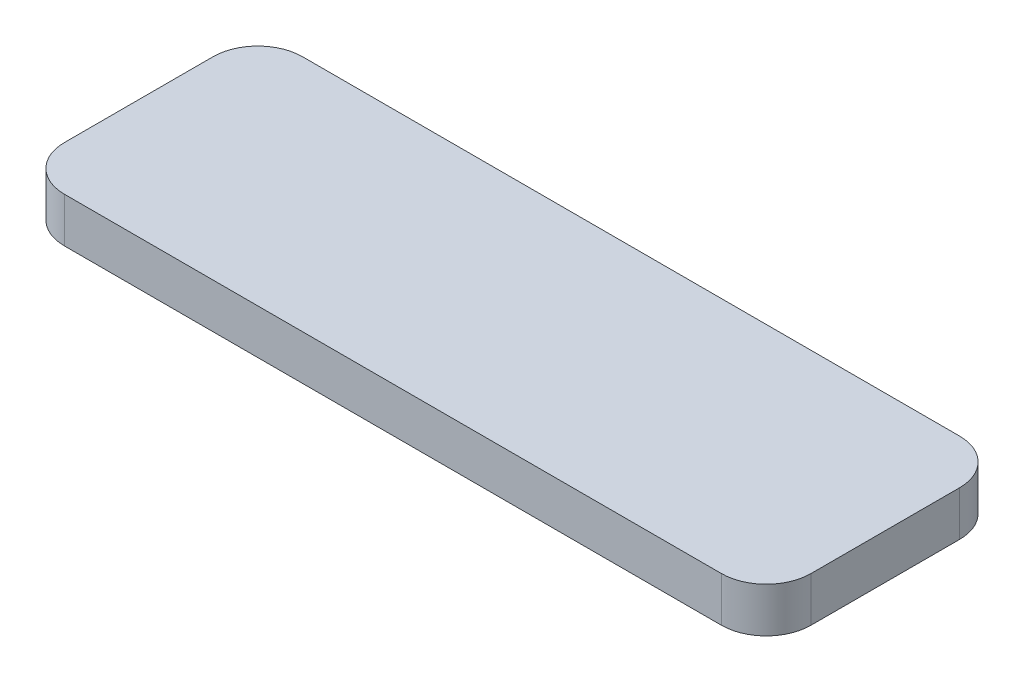
ISO-10303-21;
HEADER;
FILE_DESCRIPTION(('STEP AP214'),'2;1');
FILE_NAME('part.step','',(''),(''),'','','');
FILE_SCHEMA(('AUTOMOTIVE_DESIGN { 1 0 10303 214 1 1 1 1 }'));
ENDSEC;
DATA;
#1=APPLICATION_CONTEXT('core data for automotive mechanical design processes');
#2=APPLICATION_PROTOCOL_DEFINITION('international standard','automotive_design',2000,#1);
#3=PRODUCT_CONTEXT('',#1,'mechanical');
#4=PRODUCT('Part','Part','',(#3));
#5=PRODUCT_RELATED_PRODUCT_CATEGORY('part','',(#4));
#6=PRODUCT_DEFINITION_FORMATION('','',#4);
#7=PRODUCT_DEFINITION_CONTEXT('part definition',#1,'design');
#8=PRODUCT_DEFINITION('design','',#6,#7);
#9=PRODUCT_DEFINITION_SHAPE('','',#8);
#10=(LENGTH_UNIT() NAMED_UNIT(*) SI_UNIT(.MILLI.,.METRE.));
#11=(NAMED_UNIT(*) PLANE_ANGLE_UNIT() SI_UNIT($,.RADIAN.));
#12=(NAMED_UNIT(*) SI_UNIT($,.STERADIAN.) SOLID_ANGLE_UNIT());
#13=UNCERTAINTY_MEASURE_WITH_UNIT(LENGTH_MEASURE(1.E-05),#10,'distance_accuracy_value','');
#14=(GEOMETRIC_REPRESENTATION_CONTEXT(3) GLOBAL_UNCERTAINTY_ASSIGNED_CONTEXT((#13)) GLOBAL_UNIT_ASSIGNED_CONTEXT((#10,
#11,#12)) REPRESENTATION_CONTEXT('',''));
#15=CARTESIAN_POINT('',(0.,0.,0.));
#16=DIRECTION('',(0.,0.,1.));
#17=DIRECTION('',(1.,0.,0.));
#18=AXIS2_PLACEMENT_3D('',#15,#16,#17);
#19=CARTESIAN_POINT('',(0.,3.,0.));
#20=DIRECTION('',(1.,0.,0.));
#21=DIRECTION('',(0.,0.,-1.));
#22=AXIS2_PLACEMENT_3D('',#19,#20,#21);
#23=PLANE('',#22);
#24=DIRECTION('',(0.,0.,1.));
#25=VECTOR('',#24,1.);
#26=CARTESIAN_POINT('',(0.,0.,0.));
#27=LINE('',#26,#25);
#28=CARTESIAN_POINT('',(0.,0.,-12.95));
#29=VERTEX_POINT('',#28);
#30=CARTESIAN_POINT('',(0.,0.,-3.));
#31=VERTEX_POINT('',#30);
#32=EDGE_CURVE('E140',#29,#31,#27,.T.);
#33=ORIENTED_EDGE('',*,*,#32,.T.);
#34=DIRECTION('',(0.,-1.,0.));
#35=VECTOR('',#34,1.);
#36=CARTESIAN_POINT('',(0.,3.,-3.));
#37=LINE('',#36,#35);
#38=CARTESIAN_POINT('',(0.,3.,-3.));
#39=VERTEX_POINT('',#38);
#40=EDGE_CURVE('E11',#31,#39,#37,.F.);
#41=ORIENTED_EDGE('',*,*,#40,.T.);
#42=DIRECTION('',(0.,0.,1.));
#43=VECTOR('',#42,1.);
#44=CARTESIAN_POINT('',(0.,3.,0.));
#45=LINE('',#44,#43);
#46=CARTESIAN_POINT('',(0.,3.,-12.95));
#47=VERTEX_POINT('',#46);
#48=EDGE_CURVE('E138',#47,#39,#45,.T.);
#49=ORIENTED_EDGE('',*,*,#48,.F.);
#50=DIRECTION('',(0.,-1.,0.));
#51=VECTOR('',#50,1.);
#52=CARTESIAN_POINT('',(0.,3.,-12.95));
#53=LINE('',#52,#51);
#54=EDGE_CURVE('E47',#47,#29,#53,.T.);
#55=ORIENTED_EDGE('',*,*,#54,.T.);
#56=EDGE_LOOP('',(#33,#41,#49,#55));
#57=FACE_BOUND('',#56,.T.);
#58=ADVANCED_FACE('F38',(#57),#23,.F.);
#59=CARTESIAN_POINT('',(0.,3.,0.));
#60=DIRECTION('',(0.,0.,-1.));
#61=DIRECTION('',(-1.,0.,0.));
#62=AXIS2_PLACEMENT_3D('',#59,#60,#61);
#63=PLANE('',#62);
#64=DIRECTION('',(1.,0.,0.));
#65=VECTOR('',#64,1.);
#66=CARTESIAN_POINT('',(0.,0.,0.));
#67=LINE('',#66,#65);
#68=CARTESIAN_POINT('',(3.,0.,0.));
#69=VERTEX_POINT('',#68);
#70=CARTESIAN_POINT('',(47.,0.,0.));
#71=VERTEX_POINT('',#70);
#72=EDGE_CURVE('E134',#69,#71,#67,.T.);
#73=ORIENTED_EDGE('',*,*,#72,.T.);
#74=DIRECTION('',(0.,-1.,0.));
#75=VECTOR('',#74,1.);
#76=CARTESIAN_POINT('',(47.,3.,0.));
#77=LINE('',#76,#75);
#78=CARTESIAN_POINT('',(47.,3.,0.));
#79=VERTEX_POINT('',#78);
#80=EDGE_CURVE('E110',#71,#79,#77,.F.);
#81=ORIENTED_EDGE('',*,*,#80,.T.);
#82=DIRECTION('',(1.,0.,0.));
#83=VECTOR('',#82,1.);
#84=CARTESIAN_POINT('',(0.,3.,0.));
#85=LINE('',#84,#83);
#86=CARTESIAN_POINT('',(3.,3.,0.));
#87=VERTEX_POINT('',#86);
#88=EDGE_CURVE('E192',#87,#79,#85,.T.);
#89=ORIENTED_EDGE('',*,*,#88,.F.);
#90=DIRECTION('',(0.,-1.,0.));
#91=VECTOR('',#90,1.);
#92=CARTESIAN_POINT('',(3.,3.,0.));
#93=LINE('',#92,#91);
#94=EDGE_CURVE('E116',#87,#69,#93,.T.);
#95=ORIENTED_EDGE('',*,*,#94,.T.);
#96=EDGE_LOOP('',(#73,#81,#89,#95));
#97=FACE_BOUND('',#96,.T.);
#98=ADVANCED_FACE('F204',(#97),#63,.F.);
#99=CARTESIAN_POINT('',(50.,3.,0.));
#100=DIRECTION('',(-1.,0.,0.));
#101=DIRECTION('',(0.,0.,1.));
#102=AXIS2_PLACEMENT_3D('',#99,#100,#101);
#103=PLANE('',#102);
#104=DIRECTION('',(0.,0.,-1.));
#105=VECTOR('',#104,1.);
#106=CARTESIAN_POINT('',(50.,3.,0.));
#107=LINE('',#106,#105);
#108=CARTESIAN_POINT('',(50.,3.,-3.));
#109=VERTEX_POINT('',#108);
#110=CARTESIAN_POINT('',(50.,3.,-12.95));
#111=VERTEX_POINT('',#110);
#112=EDGE_CURVE('E125',#109,#111,#107,.T.);
#113=ORIENTED_EDGE('',*,*,#112,.F.);
#114=DIRECTION('',(0.,-1.,0.));
#115=VECTOR('',#114,1.);
#116=CARTESIAN_POINT('',(50.,3.,-3.));
#117=LINE('',#116,#115);
#118=CARTESIAN_POINT('',(50.,0.,-3.));
#119=VERTEX_POINT('',#118);
#120=EDGE_CURVE('E109',#109,#119,#117,.T.);
#121=ORIENTED_EDGE('',*,*,#120,.T.);
#122=DIRECTION('',(0.,0.,-1.));
#123=VECTOR('',#122,1.);
#124=CARTESIAN_POINT('',(50.,0.,0.));
#125=LINE('',#124,#123);
#126=CARTESIAN_POINT('',(50.,0.,-12.95));
#127=VERTEX_POINT('',#126);
#128=EDGE_CURVE('E123',#119,#127,#125,.T.);
#129=ORIENTED_EDGE('',*,*,#128,.T.);
#130=DIRECTION('',(0.,-1.,0.));
#131=VECTOR('',#130,1.);
#132=CARTESIAN_POINT('',(50.,3.,-12.95));
#133=LINE('',#132,#131);
#134=EDGE_CURVE('E128',#127,#111,#133,.F.);
#135=ORIENTED_EDGE('',*,*,#134,.T.);
#136=EDGE_LOOP('',(#113,#121,#129,#135));
#137=FACE_BOUND('',#136,.T.);
#138=ADVANCED_FACE('F122',(#137),#103,.F.);
#139=CARTESIAN_POINT('',(0.,3.,-15.95));
#140=DIRECTION('',(0.,0.,1.));
#141=DIRECTION('',(1.,0.,0.));
#142=AXIS2_PLACEMENT_3D('',#139,#140,#141);
#143=PLANE('',#142);
#144=DIRECTION('',(-1.,0.,0.));
#145=VECTOR('',#144,1.);
#146=CARTESIAN_POINT('',(0.,3.,-15.95));
#147=LINE('',#146,#145);
#148=CARTESIAN_POINT('',(47.,3.,-15.95));
#149=VERTEX_POINT('',#148);
#150=CARTESIAN_POINT('',(3.,3.,-15.95));
#151=VERTEX_POINT('',#150);
#152=EDGE_CURVE('E145',#149,#151,#147,.T.);
#153=ORIENTED_EDGE('',*,*,#152,.F.);
#154=DIRECTION('',(0.,-1.,0.));
#155=VECTOR('',#154,1.);
#156=CARTESIAN_POINT('',(47.,3.,-15.95));
#157=LINE('',#156,#155);
#158=CARTESIAN_POINT('',(47.,0.,-15.95));
#159=VERTEX_POINT('',#158);
#160=EDGE_CURVE('E172',#149,#159,#157,.T.);
#161=ORIENTED_EDGE('',*,*,#160,.T.);
#162=DIRECTION('',(-1.,0.,0.));
#163=VECTOR('',#162,1.);
#164=CARTESIAN_POINT('',(0.,0.,-15.95));
#165=LINE('',#164,#163);
#166=CARTESIAN_POINT('',(3.,0.,-15.95));
#167=VERTEX_POINT('',#166);
#168=EDGE_CURVE('E133',#159,#167,#165,.T.);
#169=ORIENTED_EDGE('',*,*,#168,.T.);
#170=DIRECTION('',(0.,-1.,0.));
#171=VECTOR('',#170,1.);
#172=CARTESIAN_POINT('',(3.,3.,-15.95));
#173=LINE('',#172,#171);
#174=EDGE_CURVE('E54',#167,#151,#173,.F.);
#175=ORIENTED_EDGE('',*,*,#174,.T.);
#176=EDGE_LOOP('',(#153,#161,#169,#175));
#177=FACE_BOUND('',#176,.T.);
#178=ADVANCED_FACE('F208',(#177),#143,.F.);
#179=CARTESIAN_POINT('',(0.,3.,0.));
#180=DIRECTION('',(0.,-1.,0.));
#181=DIRECTION('',(0.,0.,-1.));
#182=AXIS2_PLACEMENT_3D('',#179,#180,#181);
#183=PLANE('',#182);
#184=ORIENTED_EDGE('',*,*,#88,.T.);
#185=CARTESIAN_POINT('',(47.,3.,-3.));
#186=DIRECTION('',(0.,-1.,0.));
#187=DIRECTION('',(0.,0.,-1.));
#188=AXIS2_PLACEMENT_3D('',#185,#186,#187);
#189=CIRCLE('',#188,3.);
#190=EDGE_CURVE('E167',#79,#109,#189,.F.);
#191=ORIENTED_EDGE('',*,*,#190,.T.);
#192=ORIENTED_EDGE('',*,*,#112,.T.);
#193=CARTESIAN_POINT('',(47.,3.,-12.95));
#194=DIRECTION('',(0.,-1.,0.));
#195=DIRECTION('',(0.,0.,-1.));
#196=AXIS2_PLACEMENT_3D('',#193,#194,#195);
#197=CIRCLE('',#196,3.);
#198=EDGE_CURVE('E61',#111,#149,#197,.F.);
#199=ORIENTED_EDGE('',*,*,#198,.T.);
#200=ORIENTED_EDGE('',*,*,#152,.T.);
#201=CARTESIAN_POINT('',(3.,3.,-12.95));
#202=DIRECTION('',(0.,-1.,0.));
#203=DIRECTION('',(0.,0.,-1.));
#204=AXIS2_PLACEMENT_3D('',#201,#202,#203);
#205=CIRCLE('',#204,3.);
#206=EDGE_CURVE('E159',#151,#47,#205,.F.);
#207=ORIENTED_EDGE('',*,*,#206,.T.);
#208=ORIENTED_EDGE('',*,*,#48,.T.);
#209=CARTESIAN_POINT('',(3.,3.,-3.));
#210=DIRECTION('',(0.,-1.,0.));
#211=DIRECTION('',(0.,0.,-1.));
#212=AXIS2_PLACEMENT_3D('',#209,#210,#211);
#213=CIRCLE('',#212,3.);
#214=EDGE_CURVE('E162',#39,#87,#213,.F.);
#215=ORIENTED_EDGE('',*,*,#214,.T.);
#216=EDGE_LOOP('',(#184,#191,#192,#199,#200,#207,#208,#215));
#217=FACE_BOUND('',#216,.T.);
#218=ADVANCED_FACE('F198',(#217),#183,.F.);
#219=CARTESIAN_POINT('',(0.,0.,0.));
#220=DIRECTION('',(0.,-1.,0.));
#221=DIRECTION('',(0.,0.,-1.));
#222=AXIS2_PLACEMENT_3D('',#219,#220,#221);
#223=PLANE('',#222);
#224=ORIENTED_EDGE('',*,*,#128,.F.);
#225=CARTESIAN_POINT('',(47.,0.,-3.));
#226=DIRECTION('',(0.,-1.,0.));
#227=DIRECTION('',(0.,0.,-1.));
#228=AXIS2_PLACEMENT_3D('',#225,#226,#227);
#229=CIRCLE('',#228,3.);
#230=EDGE_CURVE('E105',#119,#71,#229,.T.);
#231=ORIENTED_EDGE('',*,*,#230,.T.);
#232=ORIENTED_EDGE('',*,*,#72,.F.);
#233=CARTESIAN_POINT('',(3.,0.,-3.));
#234=DIRECTION('',(0.,-1.,0.));
#235=DIRECTION('',(0.,0.,-1.));
#236=AXIS2_PLACEMENT_3D('',#233,#234,#235);
#237=CIRCLE('',#236,3.);
#238=EDGE_CURVE('E149',#69,#31,#237,.T.);
#239=ORIENTED_EDGE('',*,*,#238,.T.);
#240=ORIENTED_EDGE('',*,*,#32,.F.);
#241=CARTESIAN_POINT('',(3.,0.,-12.95));
#242=DIRECTION('',(0.,-1.,0.));
#243=DIRECTION('',(0.,0.,-1.));
#244=AXIS2_PLACEMENT_3D('',#241,#242,#243);
#245=CIRCLE('',#244,3.);
#246=EDGE_CURVE('E127',#29,#167,#245,.T.);
#247=ORIENTED_EDGE('',*,*,#246,.T.);
#248=ORIENTED_EDGE('',*,*,#168,.F.);
#249=CARTESIAN_POINT('',(47.,0.,-12.95));
#250=DIRECTION('',(0.,-1.,0.));
#251=DIRECTION('',(0.,0.,-1.));
#252=AXIS2_PLACEMENT_3D('',#249,#250,#251);
#253=CIRCLE('',#252,3.);
#254=EDGE_CURVE('E117',#159,#127,#253,.T.);
#255=ORIENTED_EDGE('',*,*,#254,.T.);
#256=EDGE_LOOP('',(#224,#231,#232,#239,#240,#247,#248,#255));
#257=FACE_BOUND('',#256,.T.);
#258=ADVANCED_FACE('F130',(#257),#223,.T.);
#259=CARTESIAN_POINT('',(47.,3.,-3.));
#260=DIRECTION('',(0.,-1.,0.));
#261=DIRECTION('',(0.,0.,-1.));
#262=AXIS2_PLACEMENT_3D('',#259,#260,#261);
#263=CYLINDRICAL_SURFACE('',#262,3.);
#264=ORIENTED_EDGE('',*,*,#190,.F.);
#265=ORIENTED_EDGE('',*,*,#80,.F.);
#266=ORIENTED_EDGE('',*,*,#230,.F.);
#267=ORIENTED_EDGE('',*,*,#120,.F.);
#268=EDGE_LOOP('',(#264,#265,#266,#267));
#269=FACE_BOUND('',#268,.T.);
#270=ADVANCED_FACE('F108',(#269),#263,.T.);
#271=CARTESIAN_POINT('',(47.,3.,-12.95));
#272=DIRECTION('',(0.,-1.,0.));
#273=DIRECTION('',(0.,0.,-1.));
#274=AXIS2_PLACEMENT_3D('',#271,#272,#273);
#275=CYLINDRICAL_SURFACE('',#274,3.);
#276=ORIENTED_EDGE('',*,*,#198,.F.);
#277=ORIENTED_EDGE('',*,*,#134,.F.);
#278=ORIENTED_EDGE('',*,*,#254,.F.);
#279=ORIENTED_EDGE('',*,*,#160,.F.);
#280=EDGE_LOOP('',(#276,#277,#278,#279));
#281=FACE_BOUND('',#280,.T.);
#282=ADVANCED_FACE('F207',(#281),#275,.T.);
#283=CARTESIAN_POINT('',(3.,3.,-3.));
#284=DIRECTION('',(0.,-1.,0.));
#285=DIRECTION('',(0.,0.,-1.));
#286=AXIS2_PLACEMENT_3D('',#283,#284,#285);
#287=CYLINDRICAL_SURFACE('',#286,3.);
#288=ORIENTED_EDGE('',*,*,#214,.F.);
#289=ORIENTED_EDGE('',*,*,#40,.F.);
#290=ORIENTED_EDGE('',*,*,#238,.F.);
#291=ORIENTED_EDGE('',*,*,#94,.F.);
#292=EDGE_LOOP('',(#288,#289,#290,#291));
#293=FACE_BOUND('',#292,.T.);
#294=ADVANCED_FACE('F202',(#293),#287,.T.);
#295=CARTESIAN_POINT('',(3.,3.,-12.95));
#296=DIRECTION('',(0.,-1.,0.));
#297=DIRECTION('',(0.,0.,-1.));
#298=AXIS2_PLACEMENT_3D('',#295,#296,#297);
#299=CYLINDRICAL_SURFACE('',#298,3.);
#300=ORIENTED_EDGE('',*,*,#206,.F.);
#301=ORIENTED_EDGE('',*,*,#174,.F.);
#302=ORIENTED_EDGE('',*,*,#246,.F.);
#303=ORIENTED_EDGE('',*,*,#54,.F.);
#304=EDGE_LOOP('',(#300,#301,#302,#303));
#305=FACE_BOUND('',#304,.T.);
#306=ADVANCED_FACE('F40',(#305),#299,.T.);
#307=CLOSED_SHELL('',(#58,#98,#138,#178,#218,#258,#270,#282,#294,#306));
#308=MANIFOLD_SOLID_BREP('B2',#307);
#309=ADVANCED_BREP_SHAPE_REPRESENTATION('',(#18,#308),#14);
#310=SHAPE_DEFINITION_REPRESENTATION(#9,#309);
ENDSEC;
END-ISO-10303-21;
